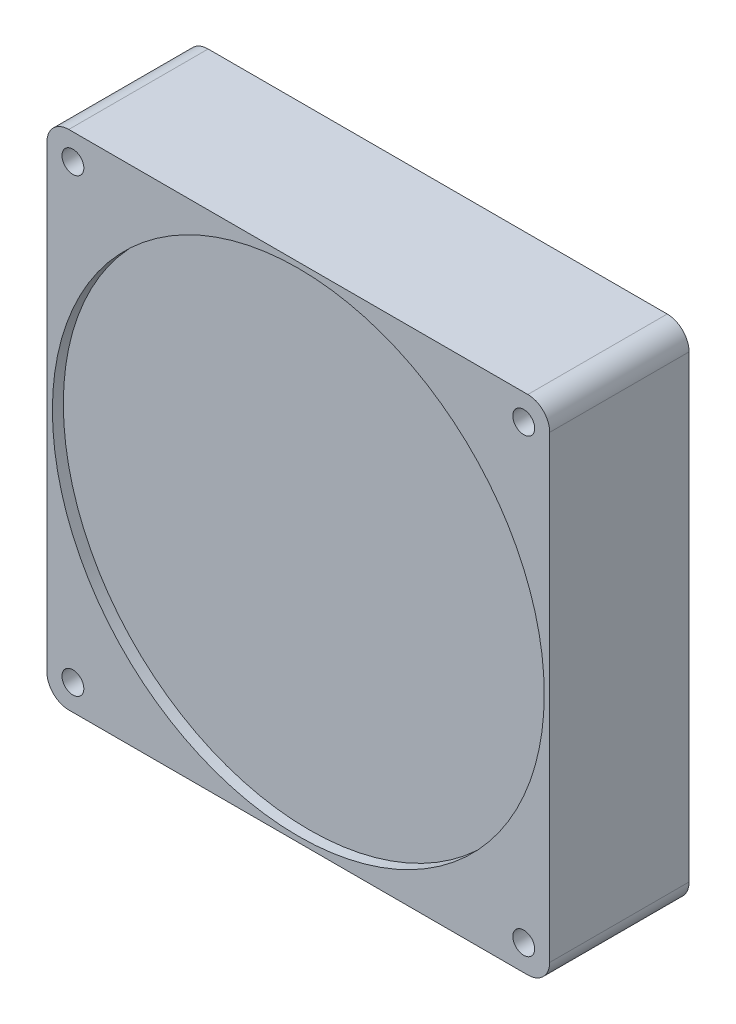
ISO-10303-21;
HEADER;
FILE_DESCRIPTION(('STEP AP214'),'2;1');
FILE_NAME('part.step','',(''),(''),'','','');
FILE_SCHEMA(('AUTOMOTIVE_DESIGN { 1 0 10303 214 1 1 1 1 }'));
ENDSEC;
DATA;
#1=APPLICATION_CONTEXT('core data for automotive mechanical design processes');
#2=APPLICATION_PROTOCOL_DEFINITION('international standard','automotive_design',2000,#1);
#3=PRODUCT_CONTEXT('',#1,'mechanical');
#4=PRODUCT('Part','Part','',(#3));
#5=PRODUCT_RELATED_PRODUCT_CATEGORY('part','',(#4));
#6=PRODUCT_DEFINITION_FORMATION('','',#4);
#7=PRODUCT_DEFINITION_CONTEXT('part definition',#1,'design');
#8=PRODUCT_DEFINITION('design','',#6,#7);
#9=PRODUCT_DEFINITION_SHAPE('','',#8);
#10=(LENGTH_UNIT() NAMED_UNIT(*) SI_UNIT(.MILLI.,.METRE.));
#11=(NAMED_UNIT(*) PLANE_ANGLE_UNIT() SI_UNIT($,.RADIAN.));
#12=(NAMED_UNIT(*) SI_UNIT($,.STERADIAN.) SOLID_ANGLE_UNIT());
#13=UNCERTAINTY_MEASURE_WITH_UNIT(LENGTH_MEASURE(1.E-05),#10,'distance_accuracy_value','');
#14=(GEOMETRIC_REPRESENTATION_CONTEXT(3) GLOBAL_UNCERTAINTY_ASSIGNED_CONTEXT((#13)) GLOBAL_UNIT_ASSIGNED_CONTEXT((#10,
#11,#12)) REPRESENTATION_CONTEXT('',''));
#15=CARTESIAN_POINT('',(0.,0.,0.));
#16=DIRECTION('',(0.,0.,1.));
#17=DIRECTION('',(1.,0.,0.));
#18=AXIS2_PLACEMENT_3D('',#15,#16,#17);
#19=CARTESIAN_POINT('',(46.,-46.,25.5));
#20=DIRECTION('',(-1.,0.,0.));
#21=DIRECTION('',(0.,0.,1.));
#22=AXIS2_PLACEMENT_3D('',#19,#20,#21);
#23=PLANE('',#22);
#24=DIRECTION('',(0.,1.,0.));
#25=VECTOR('',#24,1.);
#26=CARTESIAN_POINT('',(46.,-46.,25.5));
#27=LINE('',#26,#25);
#28=CARTESIAN_POINT('',(46.,-42.,25.5));
#29=VERTEX_POINT('',#28);
#30=CARTESIAN_POINT('',(46.,42.,25.5));
#31=VERTEX_POINT('',#30);
#32=EDGE_CURVE('E136',#29,#31,#27,.T.);
#33=ORIENTED_EDGE('',*,*,#32,.F.);
#34=DIRECTION('',(0.,0.,-1.));
#35=VECTOR('',#34,1.);
#36=CARTESIAN_POINT('',(46.,-42.,25.5));
#37=LINE('',#36,#35);
#38=CARTESIAN_POINT('',(46.,-42.,0.));
#39=VERTEX_POINT('',#38);
#40=EDGE_CURVE('E175',#29,#39,#37,.T.);
#41=ORIENTED_EDGE('',*,*,#40,.T.);
#42=DIRECTION('',(0.,1.,0.));
#43=VECTOR('',#42,1.);
#44=CARTESIAN_POINT('',(46.,-46.,0.));
#45=LINE('',#44,#43);
#46=CARTESIAN_POINT('',(46.,42.,0.));
#47=VERTEX_POINT('',#46);
#48=EDGE_CURVE('E190',#39,#47,#45,.T.);
#49=ORIENTED_EDGE('',*,*,#48,.T.);
#50=DIRECTION('',(0.,0.,-1.));
#51=VECTOR('',#50,1.);
#52=CARTESIAN_POINT('',(46.,42.,25.5));
#53=LINE('',#52,#51);
#54=EDGE_CURVE('E172',#47,#31,#53,.F.);
#55=ORIENTED_EDGE('',*,*,#54,.T.);
#56=EDGE_LOOP('',(#33,#41,#49,#55));
#57=FACE_BOUND('',#56,.T.);
#58=ADVANCED_FACE('F40',(#57),#23,.F.);
#59=CARTESIAN_POINT('',(-46.,46.,25.5));
#60=DIRECTION('',(0.,-1.,0.));
#61=DIRECTION('',(0.,0.,-1.));
#62=AXIS2_PLACEMENT_3D('',#59,#60,#61);
#63=PLANE('',#62);
#64=DIRECTION('',(-1.,0.,0.));
#65=VECTOR('',#64,1.);
#66=CARTESIAN_POINT('',(-46.,46.,25.5));
#67=LINE('',#66,#65);
#68=CARTESIAN_POINT('',(42.,46.,25.5));
#69=VERTEX_POINT('',#68);
#70=CARTESIAN_POINT('',(-42.,46.,25.5));
#71=VERTEX_POINT('',#70);
#72=EDGE_CURVE('E141',#69,#71,#67,.T.);
#73=ORIENTED_EDGE('',*,*,#72,.F.);
#74=DIRECTION('',(0.,0.,-1.));
#75=VECTOR('',#74,1.);
#76=CARTESIAN_POINT('',(42.,46.,25.5));
#77=LINE('',#76,#75);
#78=CARTESIAN_POINT('',(42.,46.,0.));
#79=VERTEX_POINT('',#78);
#80=EDGE_CURVE('E11',#69,#79,#77,.T.);
#81=ORIENTED_EDGE('',*,*,#80,.T.);
#82=DIRECTION('',(-1.,0.,0.));
#83=VECTOR('',#82,1.);
#84=CARTESIAN_POINT('',(-46.,46.,0.));
#85=LINE('',#84,#83);
#86=CARTESIAN_POINT('',(-42.,46.,0.));
#87=VERTEX_POINT('',#86);
#88=EDGE_CURVE('E143',#79,#87,#85,.T.);
#89=ORIENTED_EDGE('',*,*,#88,.T.);
#90=DIRECTION('',(0.,0.,-1.));
#91=VECTOR('',#90,1.);
#92=CARTESIAN_POINT('',(-42.,46.,25.5));
#93=LINE('',#92,#91);
#94=EDGE_CURVE('E49',#87,#71,#93,.F.);
#95=ORIENTED_EDGE('',*,*,#94,.T.);
#96=EDGE_LOOP('',(#73,#81,#89,#95));
#97=FACE_BOUND('',#96,.T.);
#98=ADVANCED_FACE('F196',(#97),#63,.F.);
#99=CARTESIAN_POINT('',(-46.,-46.,25.5));
#100=DIRECTION('',(1.,0.,0.));
#101=DIRECTION('',(0.,0.,-1.));
#102=AXIS2_PLACEMENT_3D('',#99,#100,#101);
#103=PLANE('',#102);
#104=DIRECTION('',(0.,-1.,0.));
#105=VECTOR('',#104,1.);
#106=CARTESIAN_POINT('',(-46.,-46.,0.));
#107=LINE('',#106,#105);
#108=CARTESIAN_POINT('',(-46.,42.,0.));
#109=VERTEX_POINT('',#108);
#110=CARTESIAN_POINT('',(-46.,-42.,0.));
#111=VERTEX_POINT('',#110);
#112=EDGE_CURVE('E137',#109,#111,#107,.T.);
#113=ORIENTED_EDGE('',*,*,#112,.T.);
#114=DIRECTION('',(0.,0.,-1.));
#115=VECTOR('',#114,1.);
#116=CARTESIAN_POINT('',(-46.,-42.,25.5));
#117=LINE('',#116,#115);
#118=CARTESIAN_POINT('',(-46.,-42.,25.5));
#119=VERTEX_POINT('',#118);
#120=EDGE_CURVE('E112',#111,#119,#117,.F.);
#121=ORIENTED_EDGE('',*,*,#120,.T.);
#122=DIRECTION('',(0.,-1.,0.));
#123=VECTOR('',#122,1.);
#124=CARTESIAN_POINT('',(-46.,-46.,25.5));
#125=LINE('',#124,#123);
#126=CARTESIAN_POINT('',(-46.,42.,25.5));
#127=VERTEX_POINT('',#126);
#128=EDGE_CURVE('E181',#127,#119,#125,.T.);
#129=ORIENTED_EDGE('',*,*,#128,.F.);
#130=DIRECTION('',(0.,0.,-1.));
#131=VECTOR('',#130,1.);
#132=CARTESIAN_POINT('',(-46.,42.,25.5));
#133=LINE('',#132,#131);
#134=EDGE_CURVE('E118',#127,#109,#133,.T.);
#135=ORIENTED_EDGE('',*,*,#134,.T.);
#136=EDGE_LOOP('',(#113,#121,#129,#135));
#137=FACE_BOUND('',#136,.T.);
#138=ADVANCED_FACE('F203',(#137),#103,.F.);
#139=CARTESIAN_POINT('',(-46.,-46.,25.5));
#140=DIRECTION('',(0.,1.,0.));
#141=DIRECTION('',(0.,0.,1.));
#142=AXIS2_PLACEMENT_3D('',#139,#140,#141);
#143=PLANE('',#142);
#144=DIRECTION('',(1.,0.,0.));
#145=VECTOR('',#144,1.);
#146=CARTESIAN_POINT('',(-46.,-46.,25.5));
#147=LINE('',#146,#145);
#148=CARTESIAN_POINT('',(-42.,-46.,25.5));
#149=VERTEX_POINT('',#148);
#150=CARTESIAN_POINT('',(42.,-46.,25.5));
#151=VERTEX_POINT('',#150);
#152=EDGE_CURVE('E128',#149,#151,#147,.T.);
#153=ORIENTED_EDGE('',*,*,#152,.F.);
#154=DIRECTION('',(0.,0.,-1.));
#155=VECTOR('',#154,1.);
#156=CARTESIAN_POINT('',(-42.,-46.,25.5));
#157=LINE('',#156,#155);
#158=CARTESIAN_POINT('',(-42.,-46.,0.));
#159=VERTEX_POINT('',#158);
#160=EDGE_CURVE('E111',#149,#159,#157,.T.);
#161=ORIENTED_EDGE('',*,*,#160,.T.);
#162=DIRECTION('',(1.,0.,0.));
#163=VECTOR('',#162,1.);
#164=CARTESIAN_POINT('',(-46.,-46.,0.));
#165=LINE('',#164,#163);
#166=CARTESIAN_POINT('',(42.,-46.,0.));
#167=VERTEX_POINT('',#166);
#168=EDGE_CURVE('E125',#159,#167,#165,.T.);
#169=ORIENTED_EDGE('',*,*,#168,.T.);
#170=DIRECTION('',(0.,0.,-1.));
#171=VECTOR('',#170,1.);
#172=CARTESIAN_POINT('',(42.,-46.,25.5));
#173=LINE('',#172,#171);
#174=EDGE_CURVE('E131',#167,#151,#173,.F.);
#175=ORIENTED_EDGE('',*,*,#174,.T.);
#176=EDGE_LOOP('',(#153,#161,#169,#175));
#177=FACE_BOUND('',#176,.T.);
#178=ADVANCED_FACE('F124',(#177),#143,.F.);
#179=CARTESIAN_POINT('',(0.,0.,25.5));
#180=DIRECTION('',(0.,0.,-1.));
#181=DIRECTION('',(-1.,0.,0.));
#182=AXIS2_PLACEMENT_3D('',#179,#180,#181);
#183=PLANE('',#182);
#184=CARTESIAN_POINT('',(0.,0.,25.5));
#185=DIRECTION('',(0.,0.,1.));
#186=DIRECTION('',(1.,0.,0.));
#187=AXIS2_PLACEMENT_3D('',#184,#185,#186);
#188=CIRCLE('',#187,45.);
#189=CARTESIAN_POINT('',(45.,0.,25.5));
#190=VERTEX_POINT('',#189);
#191=EDGE_CURVE('E318',#190,#190,#188,.T.);
#192=ORIENTED_EDGE('',*,*,#191,.F.);
#193=EDGE_LOOP('',(#192));
#194=FACE_BOUND('',#193,.T.);
#195=CARTESIAN_POINT('',(-41.25,-41.25,25.5));
#196=DIRECTION('',(0.,0.,1.));
#197=DIRECTION('',(1.,0.,0.));
#198=AXIS2_PLACEMENT_3D('',#195,#196,#197);
#199=CIRCLE('',#198,2.);
#200=CARTESIAN_POINT('',(-39.25,-41.25,25.5));
#201=VERTEX_POINT('',#200);
#202=EDGE_CURVE('E299',#201,#201,#199,.T.);
#203=ORIENTED_EDGE('',*,*,#202,.F.);
#204=EDGE_LOOP('',(#203));
#205=FACE_BOUND('',#204,.T.);
#206=CARTESIAN_POINT('',(41.25,-41.25,25.5));
#207=DIRECTION('',(0.,0.,1.));
#208=DIRECTION('',(1.,0.,0.));
#209=AXIS2_PLACEMENT_3D('',#206,#207,#208);
#210=CIRCLE('',#209,2.);
#211=CARTESIAN_POINT('',(43.25,-41.25,25.5));
#212=VERTEX_POINT('',#211);
#213=EDGE_CURVE('E306',#212,#212,#210,.T.);
#214=ORIENTED_EDGE('',*,*,#213,.F.);
#215=EDGE_LOOP('',(#214));
#216=FACE_BOUND('',#215,.T.);
#217=CARTESIAN_POINT('',(41.25,41.25,25.5));
#218=DIRECTION('',(0.,0.,1.));
#219=DIRECTION('',(1.,0.,0.));
#220=AXIS2_PLACEMENT_3D('',#217,#218,#219);
#221=CIRCLE('',#220,2.);
#222=CARTESIAN_POINT('',(43.25,41.25,25.5));
#223=VERTEX_POINT('',#222);
#224=EDGE_CURVE('E312',#223,#223,#221,.T.);
#225=ORIENTED_EDGE('',*,*,#224,.F.);
#226=EDGE_LOOP('',(#225));
#227=FACE_BOUND('',#226,.T.);
#228=CARTESIAN_POINT('',(-41.25,41.25,25.5));
#229=DIRECTION('',(0.,0.,1.));
#230=DIRECTION('',(1.,0.,0.));
#231=AXIS2_PLACEMENT_3D('',#228,#229,#230);
#232=CIRCLE('',#231,2.);
#233=CARTESIAN_POINT('',(-39.25,41.25,25.5));
#234=VERTEX_POINT('',#233);
#235=EDGE_CURVE('E294',#234,#234,#232,.T.);
#236=ORIENTED_EDGE('',*,*,#235,.F.);
#237=EDGE_LOOP('',(#236));
#238=FACE_BOUND('',#237,.T.);
#239=ORIENTED_EDGE('',*,*,#128,.T.);
#240=CARTESIAN_POINT('',(-42.,-42.,25.5));
#241=DIRECTION('',(0.,0.,-1.));
#242=DIRECTION('',(-1.,0.,0.));
#243=AXIS2_PLACEMENT_3D('',#240,#241,#242);
#244=CIRCLE('',#243,4.);
#245=EDGE_CURVE('E169',#119,#149,#244,.F.);
#246=ORIENTED_EDGE('',*,*,#245,.T.);
#247=ORIENTED_EDGE('',*,*,#152,.T.);
#248=CARTESIAN_POINT('',(42.,-42.,25.5));
#249=DIRECTION('',(0.,0.,-1.));
#250=DIRECTION('',(-1.,0.,0.));
#251=AXIS2_PLACEMENT_3D('',#248,#249,#250);
#252=CIRCLE('',#251,4.);
#253=EDGE_CURVE('E166',#151,#29,#252,.F.);
#254=ORIENTED_EDGE('',*,*,#253,.T.);
#255=ORIENTED_EDGE('',*,*,#32,.T.);
#256=CARTESIAN_POINT('',(42.,42.,25.5));
#257=DIRECTION('',(0.,0.,-1.));
#258=DIRECTION('',(-1.,0.,0.));
#259=AXIS2_PLACEMENT_3D('',#256,#257,#258);
#260=CIRCLE('',#259,4.);
#261=EDGE_CURVE('E62',#31,#69,#260,.F.);
#262=ORIENTED_EDGE('',*,*,#261,.T.);
#263=ORIENTED_EDGE('',*,*,#72,.T.);
#264=CARTESIAN_POINT('',(-42.,42.,25.5));
#265=DIRECTION('',(0.,0.,-1.));
#266=DIRECTION('',(-1.,0.,0.));
#267=AXIS2_PLACEMENT_3D('',#264,#265,#266);
#268=CIRCLE('',#267,4.);
#269=EDGE_CURVE('E161',#71,#127,#268,.F.);
#270=ORIENTED_EDGE('',*,*,#269,.T.);
#271=EDGE_LOOP('',(#239,#246,#247,#254,#255,#262,#263,#270));
#272=FACE_BOUND('',#271,.T.);
#273=ADVANCED_FACE('F201',(#194,#205,#216,#227,#238,#272),#183,.F.);
#274=CARTESIAN_POINT('',(0.,0.,0.));
#275=DIRECTION('',(0.,0.,-1.));
#276=DIRECTION('',(-1.,0.,0.));
#277=AXIS2_PLACEMENT_3D('',#274,#275,#276);
#278=PLANE('',#277);
#279=CARTESIAN_POINT('',(0.,0.,0.));
#280=DIRECTION('',(0.,0.,-1.));
#281=DIRECTION('',(-1.,0.,0.));
#282=AXIS2_PLACEMENT_3D('',#279,#280,#281);
#283=CIRCLE('',#282,45.);
#284=CARTESIAN_POINT('',(-45.,0.,0.));
#285=VERTEX_POINT('',#284);
#286=EDGE_CURVE('E278',#285,#285,#283,.T.);
#287=ORIENTED_EDGE('',*,*,#286,.F.);
#288=EDGE_LOOP('',(#287));
#289=FACE_BOUND('',#288,.T.);
#290=CARTESIAN_POINT('',(-41.25,-41.25,0.));
#291=DIRECTION('',(0.,0.,1.));
#292=DIRECTION('',(1.,0.,0.));
#293=AXIS2_PLACEMENT_3D('',#290,#291,#292);
#294=CIRCLE('',#293,2.);
#295=CARTESIAN_POINT('',(-39.25,-41.25,0.));
#296=VERTEX_POINT('',#295);
#297=EDGE_CURVE('E282',#296,#296,#294,.T.);
#298=ORIENTED_EDGE('',*,*,#297,.T.);
#299=EDGE_LOOP('',(#298));
#300=FACE_BOUND('',#299,.T.);
#301=CARTESIAN_POINT('',(41.25,-41.25,0.));
#302=DIRECTION('',(0.,0.,1.));
#303=DIRECTION('',(1.,0.,0.));
#304=AXIS2_PLACEMENT_3D('',#301,#302,#303);
#305=CIRCLE('',#304,2.);
#306=CARTESIAN_POINT('',(43.25,-41.25,0.));
#307=VERTEX_POINT('',#306);
#308=EDGE_CURVE('E286',#307,#307,#305,.T.);
#309=ORIENTED_EDGE('',*,*,#308,.T.);
#310=EDGE_LOOP('',(#309));
#311=FACE_BOUND('',#310,.T.);
#312=CARTESIAN_POINT('',(41.25,41.25,0.));
#313=DIRECTION('',(0.,0.,1.));
#314=DIRECTION('',(1.,0.,0.));
#315=AXIS2_PLACEMENT_3D('',#312,#313,#314);
#316=CIRCLE('',#315,2.);
#317=CARTESIAN_POINT('',(43.25,41.25,0.));
#318=VERTEX_POINT('',#317);
#319=EDGE_CURVE('E290',#318,#318,#316,.T.);
#320=ORIENTED_EDGE('',*,*,#319,.T.);
#321=EDGE_LOOP('',(#320));
#322=FACE_BOUND('',#321,.T.);
#323=CARTESIAN_POINT('',(-41.25,41.25,0.));
#324=DIRECTION('',(0.,0.,1.));
#325=DIRECTION('',(1.,0.,0.));
#326=AXIS2_PLACEMENT_3D('',#323,#324,#325);
#327=CIRCLE('',#326,2.);
#328=CARTESIAN_POINT('',(-39.25,41.25,0.));
#329=VERTEX_POINT('',#328);
#330=EDGE_CURVE('E193',#329,#329,#327,.T.);
#331=ORIENTED_EDGE('',*,*,#330,.T.);
#332=EDGE_LOOP('',(#331));
#333=FACE_BOUND('',#332,.T.);
#334=ORIENTED_EDGE('',*,*,#168,.F.);
#335=CARTESIAN_POINT('',(-42.,-42.,0.));
#336=DIRECTION('',(0.,0.,-1.));
#337=DIRECTION('',(-1.,0.,0.));
#338=AXIS2_PLACEMENT_3D('',#335,#336,#337);
#339=CIRCLE('',#338,4.);
#340=EDGE_CURVE('E107',#159,#111,#339,.T.);
#341=ORIENTED_EDGE('',*,*,#340,.T.);
#342=ORIENTED_EDGE('',*,*,#112,.F.);
#343=CARTESIAN_POINT('',(-42.,42.,0.));
#344=DIRECTION('',(0.,0.,-1.));
#345=DIRECTION('',(-1.,0.,0.));
#346=AXIS2_PLACEMENT_3D('',#343,#344,#345);
#347=CIRCLE('',#346,4.);
#348=EDGE_CURVE('E130',#109,#87,#347,.T.);
#349=ORIENTED_EDGE('',*,*,#348,.T.);
#350=ORIENTED_EDGE('',*,*,#88,.F.);
#351=CARTESIAN_POINT('',(42.,42.,0.));
#352=DIRECTION('',(0.,0.,-1.));
#353=DIRECTION('',(-1.,0.,0.));
#354=AXIS2_PLACEMENT_3D('',#351,#352,#353);
#355=CIRCLE('',#354,4.);
#356=EDGE_CURVE('E151',#79,#47,#355,.T.);
#357=ORIENTED_EDGE('',*,*,#356,.T.);
#358=ORIENTED_EDGE('',*,*,#48,.F.);
#359=CARTESIAN_POINT('',(42.,-42.,0.));
#360=DIRECTION('',(0.,0.,-1.));
#361=DIRECTION('',(-1.,0.,0.));
#362=AXIS2_PLACEMENT_3D('',#359,#360,#361);
#363=CIRCLE('',#362,4.);
#364=EDGE_CURVE('E119',#39,#167,#363,.T.);
#365=ORIENTED_EDGE('',*,*,#364,.T.);
#366=EDGE_LOOP('',(#334,#341,#342,#349,#350,#357,#358,#365));
#367=FACE_BOUND('',#366,.T.);
#368=ADVANCED_FACE('F133',(#289,#300,#311,#322,#333,#367),#278,.T.);
#369=CARTESIAN_POINT('',(-41.25,41.25,0.));
#370=DIRECTION('',(0.,0.,1.));
#371=DIRECTION('',(1.,0.,0.));
#372=AXIS2_PLACEMENT_3D('',#369,#370,#371);
#373=CYLINDRICAL_SURFACE('',#372,2.);
#374=ORIENTED_EDGE('',*,*,#330,.F.);
#375=EDGE_LOOP('',(#374));
#376=FACE_BOUND('',#375,.T.);
#377=ORIENTED_EDGE('',*,*,#235,.T.);
#378=EDGE_LOOP('',(#377));
#379=FACE_BOUND('',#378,.T.);
#380=ADVANCED_FACE('F255',(#376,#379),#373,.F.);
#381=CARTESIAN_POINT('',(41.25,41.25,0.));
#382=DIRECTION('',(0.,0.,1.));
#383=DIRECTION('',(1.,0.,0.));
#384=AXIS2_PLACEMENT_3D('',#381,#382,#383);
#385=CYLINDRICAL_SURFACE('',#384,2.);
#386=ORIENTED_EDGE('',*,*,#319,.F.);
#387=EDGE_LOOP('',(#386));
#388=FACE_BOUND('',#387,.T.);
#389=ORIENTED_EDGE('',*,*,#224,.T.);
#390=EDGE_LOOP('',(#389));
#391=FACE_BOUND('',#390,.T.);
#392=ADVANCED_FACE('F251',(#388,#391),#385,.F.);
#393=CARTESIAN_POINT('',(41.25,-41.25,0.));
#394=DIRECTION('',(0.,0.,1.));
#395=DIRECTION('',(1.,0.,0.));
#396=AXIS2_PLACEMENT_3D('',#393,#394,#395);
#397=CYLINDRICAL_SURFACE('',#396,2.);
#398=ORIENTED_EDGE('',*,*,#308,.F.);
#399=EDGE_LOOP('',(#398));
#400=FACE_BOUND('',#399,.T.);
#401=ORIENTED_EDGE('',*,*,#213,.T.);
#402=EDGE_LOOP('',(#401));
#403=FACE_BOUND('',#402,.T.);
#404=ADVANCED_FACE('F254',(#400,#403),#397,.F.);
#405=CARTESIAN_POINT('',(-41.25,-41.25,0.));
#406=DIRECTION('',(0.,0.,1.));
#407=DIRECTION('',(1.,0.,0.));
#408=AXIS2_PLACEMENT_3D('',#405,#406,#407);
#409=CYLINDRICAL_SURFACE('',#408,2.);
#410=ORIENTED_EDGE('',*,*,#297,.F.);
#411=EDGE_LOOP('',(#410));
#412=FACE_BOUND('',#411,.T.);
#413=ORIENTED_EDGE('',*,*,#202,.T.);
#414=EDGE_LOOP('',(#413));
#415=FACE_BOUND('',#414,.T.);
#416=ADVANCED_FACE('F222',(#412,#415),#409,.F.);
#417=CARTESIAN_POINT('',(-42.,-42.,25.5));
#418=DIRECTION('',(0.,0.,-1.));
#419=DIRECTION('',(-1.,0.,0.));
#420=AXIS2_PLACEMENT_3D('',#417,#418,#419);
#421=CYLINDRICAL_SURFACE('',#420,4.);
#422=ORIENTED_EDGE('',*,*,#245,.F.);
#423=ORIENTED_EDGE('',*,*,#120,.F.);
#424=ORIENTED_EDGE('',*,*,#340,.F.);
#425=ORIENTED_EDGE('',*,*,#160,.F.);
#426=EDGE_LOOP('',(#422,#423,#424,#425));
#427=FACE_BOUND('',#426,.T.);
#428=ADVANCED_FACE('F110',(#427),#421,.T.);
#429=CARTESIAN_POINT('',(42.,-42.,25.5));
#430=DIRECTION('',(0.,0.,-1.));
#431=DIRECTION('',(-1.,0.,0.));
#432=AXIS2_PLACEMENT_3D('',#429,#430,#431);
#433=CYLINDRICAL_SURFACE('',#432,4.);
#434=ORIENTED_EDGE('',*,*,#253,.F.);
#435=ORIENTED_EDGE('',*,*,#174,.F.);
#436=ORIENTED_EDGE('',*,*,#364,.F.);
#437=ORIENTED_EDGE('',*,*,#40,.F.);
#438=EDGE_LOOP('',(#434,#435,#436,#437));
#439=FACE_BOUND('',#438,.T.);
#440=ADVANCED_FACE('F221',(#439),#433,.T.);
#441=CARTESIAN_POINT('',(42.,42.,25.5));
#442=DIRECTION('',(0.,0.,-1.));
#443=DIRECTION('',(-1.,0.,0.));
#444=AXIS2_PLACEMENT_3D('',#441,#442,#443);
#445=CYLINDRICAL_SURFACE('',#444,4.);
#446=ORIENTED_EDGE('',*,*,#261,.F.);
#447=ORIENTED_EDGE('',*,*,#54,.F.);
#448=ORIENTED_EDGE('',*,*,#356,.F.);
#449=ORIENTED_EDGE('',*,*,#80,.F.);
#450=EDGE_LOOP('',(#446,#447,#448,#449));
#451=FACE_BOUND('',#450,.T.);
#452=ADVANCED_FACE('F224',(#451),#445,.T.);
#453=CARTESIAN_POINT('',(-42.,42.,25.5));
#454=DIRECTION('',(0.,0.,-1.));
#455=DIRECTION('',(-1.,0.,0.));
#456=AXIS2_PLACEMENT_3D('',#453,#454,#455);
#457=CYLINDRICAL_SURFACE('',#456,4.);
#458=ORIENTED_EDGE('',*,*,#269,.F.);
#459=ORIENTED_EDGE('',*,*,#94,.F.);
#460=ORIENTED_EDGE('',*,*,#348,.F.);
#461=ORIENTED_EDGE('',*,*,#134,.F.);
#462=EDGE_LOOP('',(#458,#459,#460,#461));
#463=FACE_BOUND('',#462,.T.);
#464=ADVANCED_FACE('F42',(#463),#457,.T.);
#465=CARTESIAN_POINT('',(0.,0.,23.5));
#466=DIRECTION('',(0.,0.,1.));
#467=DIRECTION('',(1.,0.,0.));
#468=AXIS2_PLACEMENT_3D('',#465,#466,#467);
#469=CYLINDRICAL_SURFACE('',#468,45.);
#470=CARTESIAN_POINT('',(0.,0.,23.5));
#471=DIRECTION('',(0.,0.,1.));
#472=DIRECTION('',(1.,0.,0.));
#473=AXIS2_PLACEMENT_3D('',#470,#471,#472);
#474=CIRCLE('',#473,45.);
#475=CARTESIAN_POINT('',(45.,0.,23.5));
#476=VERTEX_POINT('',#475);
#477=EDGE_CURVE('E303',#476,#476,#474,.T.);
#478=ORIENTED_EDGE('',*,*,#477,.F.);
#479=EDGE_LOOP('',(#478));
#480=FACE_BOUND('',#479,.T.);
#481=ORIENTED_EDGE('',*,*,#191,.T.);
#482=EDGE_LOOP('',(#481));
#483=FACE_BOUND('',#482,.T.);
#484=ADVANCED_FACE('F231',(#480,#483),#469,.F.);
#485=CARTESIAN_POINT('',(0.,0.,23.5));
#486=DIRECTION('',(0.,0.,1.));
#487=DIRECTION('',(1.,0.,0.));
#488=AXIS2_PLACEMENT_3D('',#485,#486,#487);
#489=PLANE('',#488);
#490=ORIENTED_EDGE('',*,*,#477,.T.);
#491=EDGE_LOOP('',(#490));
#492=FACE_BOUND('',#491,.T.);
#493=ADVANCED_FACE('F238',(#492),#489,.T.);
#494=CARTESIAN_POINT('',(0.,0.,2.));
#495=DIRECTION('',(0.,0.,-1.));
#496=DIRECTION('',(-1.,0.,0.));
#497=AXIS2_PLACEMENT_3D('',#494,#495,#496);
#498=CYLINDRICAL_SURFACE('',#497,45.);
#499=CARTESIAN_POINT('',(0.,0.,2.));
#500=DIRECTION('',(0.,0.,-1.));
#501=DIRECTION('',(-1.,0.,0.));
#502=AXIS2_PLACEMENT_3D('',#499,#500,#501);
#503=CIRCLE('',#502,45.);
#504=CARTESIAN_POINT('',(-45.,0.,2.));
#505=VERTEX_POINT('',#504);
#506=EDGE_CURVE('E322',#505,#505,#503,.T.);
#507=ORIENTED_EDGE('',*,*,#506,.F.);
#508=EDGE_LOOP('',(#507));
#509=FACE_BOUND('',#508,.T.);
#510=ORIENTED_EDGE('',*,*,#286,.T.);
#511=EDGE_LOOP('',(#510));
#512=FACE_BOUND('',#511,.T.);
#513=ADVANCED_FACE('F244',(#509,#512),#498,.F.);
#514=CARTESIAN_POINT('',(0.,0.,2.));
#515=DIRECTION('',(0.,0.,-1.));
#516=DIRECTION('',(-1.,0.,0.));
#517=AXIS2_PLACEMENT_3D('',#514,#515,#516);
#518=PLANE('',#517);
#519=ORIENTED_EDGE('',*,*,#506,.T.);
#520=EDGE_LOOP('',(#519));
#521=FACE_BOUND('',#520,.T.);
#522=ADVANCED_FACE('F332',(#521),#518,.T.);
#523=CLOSED_SHELL('',(#58,#98,#138,#178,#273,#368,#380,#392,#404,#416,#428,#440,#452,#464,#484,
#493,#513,#522));
#524=MANIFOLD_SOLID_BREP('B2',#523);
#525=ADVANCED_BREP_SHAPE_REPRESENTATION('',(#18,#524),#14);
#526=SHAPE_DEFINITION_REPRESENTATION(#9,#525);
ENDSEC;
END-ISO-10303-21;
